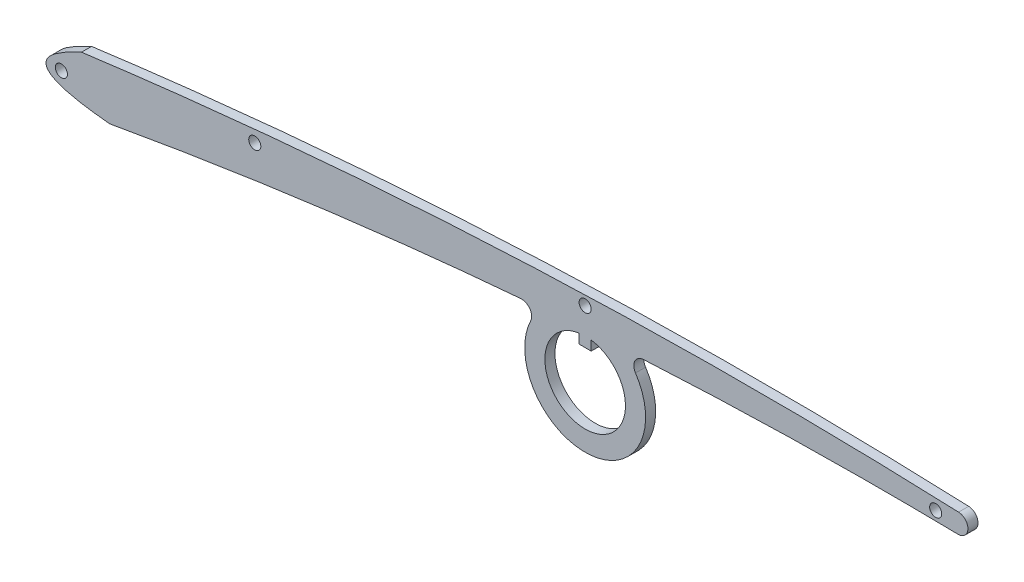
ISO-10303-21;
HEADER;
FILE_DESCRIPTION(('STEP AP214'),'2;1');
FILE_NAME('part.step','',(''),(''),'','','');
FILE_SCHEMA(('AUTOMOTIVE_DESIGN { 1 0 10303 214 1 1 1 1 }'));
ENDSEC;
DATA;
#1=APPLICATION_CONTEXT('core data for automotive mechanical design processes');
#2=APPLICATION_PROTOCOL_DEFINITION('international standard','automotive_design',2000,#1);
#3=PRODUCT_CONTEXT('',#1,'mechanical');
#4=PRODUCT('Part','Part','',(#3));
#5=PRODUCT_RELATED_PRODUCT_CATEGORY('part','',(#4));
#6=PRODUCT_DEFINITION_FORMATION('','',#4);
#7=PRODUCT_DEFINITION_CONTEXT('part definition',#1,'design');
#8=PRODUCT_DEFINITION('design','',#6,#7);
#9=PRODUCT_DEFINITION_SHAPE('','',#8);
#10=(LENGTH_UNIT() NAMED_UNIT(*) SI_UNIT(.MILLI.,.METRE.));
#11=(NAMED_UNIT(*) PLANE_ANGLE_UNIT() SI_UNIT($,.RADIAN.));
#12=(NAMED_UNIT(*) SI_UNIT($,.STERADIAN.) SOLID_ANGLE_UNIT());
#13=UNCERTAINTY_MEASURE_WITH_UNIT(LENGTH_MEASURE(1.E-05),#10,'distance_accuracy_value','');
#14=(GEOMETRIC_REPRESENTATION_CONTEXT(3) GLOBAL_UNCERTAINTY_ASSIGNED_CONTEXT((#13)) GLOBAL_UNIT_ASSIGNED_CONTEXT((#10,
#11,#12)) REPRESENTATION_CONTEXT('',''));
#15=CARTESIAN_POINT('',(0.,0.,0.));
#16=DIRECTION('',(0.,0.,1.));
#17=DIRECTION('',(1.,0.,0.));
#18=AXIS2_PLACEMENT_3D('',#15,#16,#17);
#19=CARTESIAN_POINT('',(43.5360182210527,1.99727418723005,0.3));
#20=CARTESIAN_POINT('',(43.5360182210527,1.99727418723005,0.283333333333333));
#21=CARTESIAN_POINT('',(43.5360182210524,1.99727418723005,0.266666666666667));
#22=CARTESIAN_POINT('',(43.5360182210524,1.99727418723005,0.0833333333333292));
#23=CARTESIAN_POINT('',(43.5360182210524,1.99727418723005,-0.0833333333333294));
#24=CARTESIAN_POINT('',(43.5360182210524,1.99727418723005,-0.266666666666667));
#25=CARTESIAN_POINT('',(43.5360182210527,1.99727418723005,-0.283333333333333));
#26=CARTESIAN_POINT('',(43.5360182210527,1.99727418723005,-0.3));
#27=CARTESIAN_POINT('',(44.4810390585838,1.95872875985098,0.3));
#28=CARTESIAN_POINT('',(44.4810390585838,1.95872875985098,0.283333333333333));
#29=CARTESIAN_POINT('',(44.4810390585842,1.95872875985125,0.266666666666667));
#30=CARTESIAN_POINT('',(44.4810390585842,1.95872875985125,0.0833333333333292));
#31=CARTESIAN_POINT('',(44.4810390585842,1.95872875985125,-0.0833333333333294));
#32=CARTESIAN_POINT('',(44.4810390585842,1.95872875985125,-0.266666666666667));
#33=CARTESIAN_POINT('',(44.4810390585838,1.95872875985098,-0.283333333333333));
#34=CARTESIAN_POINT('',(44.4810390585838,1.95872875985098,-0.3));
#35=CARTESIAN_POINT('',(44.4532468518573,1.01333057570577,0.3));
#36=CARTESIAN_POINT('',(44.4532468518573,1.01333057570577,0.283333333333333));
#37=CARTESIAN_POINT('',(44.4532468518577,1.01333057570546,0.266666666666667));
#38=CARTESIAN_POINT('',(44.4532468518577,1.01333057570546,0.0833333333333292));
#39=CARTESIAN_POINT('',(44.4532468518577,1.01333057570546,-0.0833333333333294));
#40=CARTESIAN_POINT('',(44.4532468518577,1.01333057570546,-0.266666666666667));
#41=CARTESIAN_POINT('',(44.4532468518573,1.01333057570577,-0.283333333333333));
#42=CARTESIAN_POINT('',(44.4532468518573,1.01333057570577,-0.3));
#43=CARTESIAN_POINT('',(43.5075936760809,1.03036596486664,0.3));
#44=CARTESIAN_POINT('',(43.5075936760809,1.03036596486664,0.283333333333333));
#45=CARTESIAN_POINT('',(43.5075936760807,1.03036596486664,0.266666666666667));
#46=CARTESIAN_POINT('',(43.5075936760807,1.03036596486664,0.0833333333333292));
#47=CARTESIAN_POINT('',(43.5075936760807,1.03036596486664,-0.0833333333333294));
#48=CARTESIAN_POINT('',(43.5075936760807,1.03036596486664,-0.266666666666667));
#49=CARTESIAN_POINT('',(43.5075936760809,1.03036596486664,-0.283333333333333));
#50=CARTESIAN_POINT('',(43.5075936760809,1.03036596486664,-0.3));
#51=(BOUNDED_SURFACE() B_SPLINE_SURFACE(3,3,((#19,#20,#21,#22,#23,#24,#25,#26),(#27,#28,#29,#30,
#31,#32,#33,#34),(#35,#36,#37,#38,#39,#40,#41,#42),(#43,#44,#45,#46,#47,#48,#49,#50)),
.UNSPECIFIED.,.F.,.F.,.F.) B_SPLINE_SURFACE_WITH_KNOTS((4,4),(4,2,2,4),(0.,1.),(-0.1,0.,1.,1.1),
.UNSPECIFIED.) GEOMETRIC_REPRESENTATION_ITEM() RATIONAL_B_SPLINE_SURFACE(((1.,1.,1.,1.,1.,1.,1.,
1.),(0.340917452765381,0.340917452765381,0.340917452765175,0.340917452765175,0.340917452765175,
0.340917452765175,0.340917452765381,0.340917452765381),(0.340917452765381,0.340917452765381,
0.340917452765175,0.340917452765175,0.340917452765175,0.340917452765175,0.340917452765381,
0.340917452765381),(1.,1.,1.,1.,1.,1.,1.,1.))) REPRESENTATION_ITEM('') SURFACE());
#52=CARTESIAN_POINT('',(43.5360182210524,1.99727418723005,0.250000000000008));
#53=DIRECTION('',(0.,0.,-1.));
#54=VECTOR('',#53,1.);
#55=LINE('',#52,#54);
#56=CARTESIAN_POINT('',(43.5360182210524,1.99727418723005,0.25));
#57=VERTEX_POINT('',#56);
#58=CARTESIAN_POINT('',(43.5360182210524,1.99727418723005,-0.25));
#59=VERTEX_POINT('',#58);
#60=EDGE_CURVE('E246',#57,#59,#55,.T.);
#61=CARTESIAN_POINT('',(43.5360182210524,1.99727418723005,0.25));
#62=CARTESIAN_POINT('',(44.4810390585842,1.95872875985125,0.25));
#63=CARTESIAN_POINT('',(44.4532468518577,1.01333057570546,0.25));
#64=CARTESIAN_POINT('',(43.5075936760807,1.03036596486664,0.25));
#65=(BOUNDED_CURVE() B_SPLINE_CURVE(3,(#61,#62,#63,#64),.UNSPECIFIED.,.F.,
.F.) B_SPLINE_CURVE_WITH_KNOTS((4,4),(0.,1.),
.UNSPECIFIED.) CURVE() GEOMETRIC_REPRESENTATION_ITEM() RATIONAL_B_SPLINE_CURVE((1.,
0.340917452765175,0.340917452765175,1.)) REPRESENTATION_ITEM(''));
#66=CARTESIAN_POINT('',(43.5075936760807,1.03036596486664,0.25));
#67=VERTEX_POINT('',#66);
#68=EDGE_CURVE('E49',#67,#57,#65,.F.);
#69=CARTESIAN_POINT('',(43.5075936760807,1.03036596486664,-0.250000000000009));
#70=DIRECTION('',(0.,0.,1.));
#71=VECTOR('',#70,1.);
#72=LINE('',#69,#71);
#73=CARTESIAN_POINT('',(43.5075936760807,1.03036596486664,-0.25));
#74=VERTEX_POINT('',#73);
#75=EDGE_CURVE('E251',#74,#67,#72,.T.);
#76=CARTESIAN_POINT('',(43.5075936760807,1.03036596486664,-0.25));
#77=CARTESIAN_POINT('',(44.4532468518577,1.01333057570546,-0.25));
#78=CARTESIAN_POINT('',(44.4810390585842,1.95872875985125,-0.25));
#79=CARTESIAN_POINT('',(43.5360182210524,1.99727418723005,-0.25));
#80=(BOUNDED_CURVE() B_SPLINE_CURVE(3,(#76,#77,#78,#79),.UNSPECIFIED.,.F.,
.F.) B_SPLINE_CURVE_WITH_KNOTS((4,4),(0.,1.),
.UNSPECIFIED.) CURVE() GEOMETRIC_REPRESENTATION_ITEM() RATIONAL_B_SPLINE_CURVE((1.,
0.340917452765175,0.340917452765175,1.)) REPRESENTATION_ITEM(''));
#81=EDGE_CURVE('E11',#59,#74,#80,.F.);
#82=ORIENTED_EDGE('',*,*,#60,.F.);
#83=ORIENTED_EDGE('',*,*,#68,.F.);
#84=ORIENTED_EDGE('',*,*,#75,.F.);
#85=ORIENTED_EDGE('',*,*,#81,.F.);
#86=EDGE_LOOP('',(#82,#83,#84,#85));
#87=FACE_BOUND('',#86,.T.);
#88=ADVANCED_FACE('F36',(#87),#51,.T.);
#89=CARTESIAN_POINT('',(1.4,-2.38,0.25));
#90=CARTESIAN_POINT('',(47.9545618267195,5.97686786365619,0.25));
#91=CARTESIAN_POINT('',(94.,-5.94,0.25));
#92=B_SPLINE_CURVE_WITH_KNOTS('',2,(#89,#90,#91),.UNSPECIFIED.,.F.,.F.,(3,3),(0.,1.),.UNSPECIFIED.);
#93=DIRECTION('',(0.,0.,-1.));
#94=VECTOR('',#93,1.);
#95=SURFACE_OF_LINEAR_EXTRUSION('',#92,#94);
#96=CARTESIAN_POINT('',(1.4,-2.38,-0.25));
#97=CARTESIAN_POINT('',(47.9545618267195,5.97686786365619,-0.25));
#98=CARTESIAN_POINT('',(94.,-5.94,-0.25));
#99=B_SPLINE_CURVE_WITH_KNOTS('',2,(#96,#97,#98),.UNSPECIFIED.,.F.,.F.,(3,3),(0.,1.),.UNSPECIFIED.);
#100=CARTESIAN_POINT('',(1.4,-2.38,-0.25));
#101=VERTEX_POINT('',#100);
#102=CARTESIAN_POINT('',(21.8018402597414,0.310938770262004,-0.25));
#103=VERTEX_POINT('',#102);
#104=EDGE_CURVE('E298',#101,#103,#99,.T.);
#105=ORIENTED_EDGE('',*,*,#104,.T.);
#106=DIRECTION('',(0.,0.,-1.));
#107=VECTOR('',#106,1.);
#108=CARTESIAN_POINT('',(21.8018402597414,0.310938770262003,-0.25));
#109=LINE('',#108,#107);
#110=CARTESIAN_POINT('',(21.8018402597414,0.310938770262004,0.25));
#111=VERTEX_POINT('',#110);
#112=EDGE_CURVE('E321',#103,#111,#109,.F.);
#113=ORIENTED_EDGE('',*,*,#112,.T.);
#114=CARTESIAN_POINT('',(1.4,-2.38,0.25));
#115=VERTEX_POINT('',#114);
#116=EDGE_CURVE('E211',#115,#111,#92,.T.);
#117=ORIENTED_EDGE('',*,*,#116,.F.);
#118=DIRECTION('',(0.,0.,-1.));
#119=VECTOR('',#118,1.);
#120=CARTESIAN_POINT('',(1.4,-2.38,0.25));
#121=LINE('',#120,#119);
#122=EDGE_CURVE('E262',#115,#101,#121,.T.);
#123=ORIENTED_EDGE('',*,*,#122,.T.);
#124=EDGE_LOOP('',(#105,#113,#117,#123));
#125=FACE_BOUND('',#124,.T.);
#126=ADVANCED_FACE('F227',(#125),#95,.F.);
#127=CARTESIAN_POINT('',(27.8873530453311,0.736269524725093,-0.25));
#128=VERTEX_POINT('',#127);
#129=EDGE_CURVE('E290',#128,#74,#99,.T.);
#130=ORIENTED_EDGE('',*,*,#129,.T.);
#131=ORIENTED_EDGE('',*,*,#75,.T.);
#132=CARTESIAN_POINT('',(27.8873530453311,0.736269524725093,0.25));
#133=VERTEX_POINT('',#132);
#134=EDGE_CURVE('E209',#133,#67,#92,.T.);
#135=ORIENTED_EDGE('',*,*,#134,.F.);
#136=DIRECTION('',(0.,0.,-1.));
#137=VECTOR('',#136,1.);
#138=CARTESIAN_POINT('',(27.8873530453311,0.736269524725093,0.25));
#139=LINE('',#138,#137);
#140=EDGE_CURVE('E323',#133,#128,#139,.T.);
#141=ORIENTED_EDGE('',*,*,#140,.T.);
#142=EDGE_LOOP('',(#130,#131,#135,#141));
#143=FACE_BOUND('',#142,.T.);
#144=ADVANCED_FACE('F225',(#143),#95,.F.);
#145=CARTESIAN_POINT('',(0.,0.,0.25));
#146=CARTESIAN_POINT('',(-4.123736473106,-1.85948761779572,0.25));
#147=CARTESIAN_POINT('',(1.4,-2.38,0.25));
#148=B_SPLINE_CURVE_WITH_KNOTS('',2,(#145,#146,#147),.UNSPECIFIED.,.F.,.F.,(3,3),(0.,1.),.UNSPECIFIED.);
#149=DIRECTION('',(0.,0.,-1.));
#150=VECTOR('',#149,1.);
#151=SURFACE_OF_LINEAR_EXTRUSION('',#148,#150);
#152=CARTESIAN_POINT('',(0.,0.,-0.25));
#153=CARTESIAN_POINT('',(-4.123736473106,-1.85948761779572,-0.25));
#154=CARTESIAN_POINT('',(1.4,-2.38,-0.25));
#155=B_SPLINE_CURVE_WITH_KNOTS('',2,(#152,#153,#154),.UNSPECIFIED.,.F.,.F.,(3,3),(0.,1.),.UNSPECIFIED.);
#156=CARTESIAN_POINT('',(0.,0.,-0.25));
#157=VERTEX_POINT('',#156);
#158=EDGE_CURVE('E182',#157,#101,#155,.T.);
#159=ORIENTED_EDGE('',*,*,#158,.T.);
#160=ORIENTED_EDGE('',*,*,#122,.F.);
#161=CARTESIAN_POINT('',(0.,0.,0.25));
#162=VERTEX_POINT('',#161);
#163=EDGE_CURVE('E203',#162,#115,#148,.T.);
#164=ORIENTED_EDGE('',*,*,#163,.F.);
#165=DIRECTION('',(0.,0.,-1.));
#166=VECTOR('',#165,1.);
#167=CARTESIAN_POINT('',(0.,0.,0.25));
#168=LINE('',#167,#166);
#169=EDGE_CURVE('E258',#162,#157,#168,.T.);
#170=ORIENTED_EDGE('',*,*,#169,.T.);
#171=EDGE_LOOP('',(#159,#160,#164,#170));
#172=FACE_BOUND('',#171,.T.);
#173=ADVANCED_FACE('F220',(#172),#151,.F.);
#174=CARTESIAN_POINT('',(94.3,-5.23,0.25));
#175=CARTESIAN_POINT('',(47.2732663174782,6.25577884848937,0.25));
#176=CARTESIAN_POINT('',(0.,0.,0.25));
#177=B_SPLINE_CURVE_WITH_KNOTS('',2,(#174,#175,#176),.UNSPECIFIED.,.F.,.F.,(3,3),(0.,1.),.UNSPECIFIED.);
#178=DIRECTION('',(0.,0.,-1.));
#179=VECTOR('',#178,1.);
#180=SURFACE_OF_LINEAR_EXTRUSION('',#177,#179);
#181=EDGE_CURVE('E256',#57,#162,#177,.T.);
#182=ORIENTED_EDGE('',*,*,#181,.F.);
#183=ORIENTED_EDGE('',*,*,#60,.T.);
#184=CARTESIAN_POINT('',(94.3,-5.23,-0.25));
#185=CARTESIAN_POINT('',(47.2732663174782,6.25577884848937,-0.25));
#186=CARTESIAN_POINT('',(0.,0.,-0.25));
#187=B_SPLINE_CURVE_WITH_KNOTS('',2,(#184,#185,#186),.UNSPECIFIED.,.F.,.F.,(3,3),(0.,1.),.UNSPECIFIED.);
#188=EDGE_CURVE('E210',#59,#157,#187,.T.);
#189=ORIENTED_EDGE('',*,*,#188,.T.);
#190=ORIENTED_EDGE('',*,*,#169,.F.);
#191=EDGE_LOOP('',(#182,#183,#189,#190));
#192=FACE_BOUND('',#191,.T.);
#193=ADVANCED_FACE('F224',(#192),#180,.F.);
#194=CARTESIAN_POINT('',(-1.711868236553,-1.52474380889786,0.25));
#195=DIRECTION('',(0.,0.,-1.));
#196=DIRECTION('',(-1.,0.,0.));
#197=AXIS2_PLACEMENT_3D('',#194,#195,#196);
#198=PLANE('',#197);
#199=CARTESIAN_POINT('',(-1.,-1.3,0.25));
#200=DIRECTION('',(0.,0.,1.));
#201=DIRECTION('',(1.,0.,0.));
#202=AXIS2_PLACEMENT_3D('',#199,#200,#201);
#203=CIRCLE('',#202,0.3);
#204=CARTESIAN_POINT('',(-0.7,-1.3,0.25));
#205=VERTEX_POINT('',#204);
#206=EDGE_CURVE('E183',#205,#205,#203,.T.);
#207=ORIENTED_EDGE('',*,*,#206,.F.);
#208=EDGE_LOOP('',(#207));
#209=FACE_BOUND('',#208,.T.);
#210=CARTESIAN_POINT('',(8.6,0.4,0.25));
#211=DIRECTION('',(0.,0.,1.));
#212=DIRECTION('',(1.,0.,0.));
#213=AXIS2_PLACEMENT_3D('',#210,#211,#212);
#214=CIRCLE('',#213,0.3);
#215=CARTESIAN_POINT('',(8.9,0.4,0.25));
#216=VERTEX_POINT('',#215);
#217=EDGE_CURVE('E189',#216,#216,#214,.T.);
#218=ORIENTED_EDGE('',*,*,#217,.F.);
#219=EDGE_LOOP('',(#218));
#220=FACE_BOUND('',#219,.T.);
#221=CARTESIAN_POINT('',(25.,1.6,0.25));
#222=DIRECTION('',(0.,0.,1.));
#223=DIRECTION('',(1.,0.,0.));
#224=AXIS2_PLACEMENT_3D('',#221,#222,#223);
#225=CIRCLE('',#224,0.300000000000004);
#226=CARTESIAN_POINT('',(25.3,1.6,0.25));
#227=VERTEX_POINT('',#226);
#228=EDGE_CURVE('E195',#227,#227,#225,.T.);
#229=ORIENTED_EDGE('',*,*,#228,.F.);
#230=EDGE_LOOP('',(#229));
#231=FACE_BOUND('',#230,.T.);
#232=CARTESIAN_POINT('',(42.4,1.5,0.25));
#233=DIRECTION('',(0.,0.,1.));
#234=DIRECTION('',(1.,0.,0.));
#235=AXIS2_PLACEMENT_3D('',#232,#233,#234);
#236=CIRCLE('',#235,0.300000000000004);
#237=CARTESIAN_POINT('',(42.7,1.5,0.25));
#238=VERTEX_POINT('',#237);
#239=EDGE_CURVE('E176',#238,#238,#236,.T.);
#240=ORIENTED_EDGE('',*,*,#239,.F.);
#241=EDGE_LOOP('',(#240));
#242=FACE_BOUND('',#241,.T.);
#243=ORIENTED_EDGE('',*,*,#134,.T.);
#244=ORIENTED_EDGE('',*,*,#68,.T.);
#245=ORIENTED_EDGE('',*,*,#181,.T.);
#246=ORIENTED_EDGE('',*,*,#163,.T.);
#247=ORIENTED_EDGE('',*,*,#116,.T.);
#248=CARTESIAN_POINT('',(21.8437780933207,-0.187299343609944,0.25));
#249=DIRECTION('',(0.,0.,-1.));
#250=DIRECTION('',(-1.,0.,0.));
#251=AXIS2_PLACEMENT_3D('',#248,#249,#250);
#252=CIRCLE('',#251,0.5);
#253=CARTESIAN_POINT('',(22.2946669371312,-0.40339943737956,0.25));
#254=VERTEX_POINT('',#253);
#255=EDGE_CURVE('E328',#111,#254,#252,.T.);
#256=ORIENTED_EDGE('',*,*,#255,.T.);
#257=CARTESIAN_POINT('',(25.,-1.7,0.25));
#258=DIRECTION('',(0.,0.,1.));
#259=DIRECTION('',(1.,0.,0.));
#260=AXIS2_PLACEMENT_3D('',#257,#258,#259);
#261=CIRCLE('',#260,3.00000000000644);
#262=CARTESIAN_POINT('',(27.498666781426,-0.0396794540099003,0.25));
#263=VERTEX_POINT('',#262);
#264=EDGE_CURVE('E173',#254,#263,#261,.T.);
#265=ORIENTED_EDGE('',*,*,#264,.T.);
#266=CARTESIAN_POINT('',(27.9151112449961,0.237040636987858,0.25));
#267=DIRECTION('',(0.,0.,-1.));
#268=DIRECTION('',(-1.,0.,0.));
#269=AXIS2_PLACEMENT_3D('',#266,#267,#268);
#270=CIRCLE('',#269,0.5);
#271=EDGE_CURVE('E252',#263,#133,#270,.T.);
#272=ORIENTED_EDGE('',*,*,#271,.T.);
#273=EDGE_LOOP('',(#243,#244,#245,#246,#247,#256,#265,#272));
#274=FACE_BOUND('',#273,.T.);
#275=DIRECTION('',(0.,-1.,0.));
#276=VECTOR('',#275,1.);
#277=CARTESIAN_POINT('',(25.3,0.277371993328519,0.25));
#278=LINE('',#277,#276);
#279=CARTESIAN_POINT('',(25.3,0.277371993328519,0.25));
#280=VERTEX_POINT('',#279);
#281=CARTESIAN_POINT('',(25.3,-0.2,0.25));
#282=VERTEX_POINT('',#281);
#283=EDGE_CURVE('E141',#280,#282,#278,.T.);
#284=ORIENTED_EDGE('',*,*,#283,.F.);
#285=CARTESIAN_POINT('',(25.,-1.7,0.25));
#286=DIRECTION('',(0.,0.,1.));
#287=DIRECTION('',(1.,0.,0.));
#288=AXIS2_PLACEMENT_3D('',#285,#286,#287);
#289=CIRCLE('',#288,2.);
#290=CARTESIAN_POINT('',(24.7,0.277371993328519,0.25));
#291=VERTEX_POINT('',#290);
#292=EDGE_CURVE('E131',#291,#280,#289,.T.);
#293=ORIENTED_EDGE('',*,*,#292,.F.);
#294=DIRECTION('',(0.,1.,0.));
#295=VECTOR('',#294,1.);
#296=CARTESIAN_POINT('',(24.7,0.277371993328519,0.25));
#297=LINE('',#296,#295);
#298=CARTESIAN_POINT('',(24.7,-0.2,0.25));
#299=VERTEX_POINT('',#298);
#300=EDGE_CURVE('E157',#299,#291,#297,.T.);
#301=ORIENTED_EDGE('',*,*,#300,.F.);
#302=DIRECTION('',(-1.,0.,0.));
#303=VECTOR('',#302,1.);
#304=CARTESIAN_POINT('',(24.7,-0.2,0.25));
#305=LINE('',#304,#303);
#306=EDGE_CURVE('E155',#282,#299,#305,.T.);
#307=ORIENTED_EDGE('',*,*,#306,.F.);
#308=EDGE_LOOP('',(#284,#293,#301,#307));
#309=FACE_BOUND('',#308,.T.);
#310=ADVANCED_FACE('F153',(#209,#220,#231,#242,#274,#309),#198,.F.);
#311=CARTESIAN_POINT('',(-1.711868236553,-1.52474380889786,-0.25));
#312=DIRECTION('',(0.,0.,-1.));
#313=DIRECTION('',(-1.,0.,0.));
#314=AXIS2_PLACEMENT_3D('',#311,#312,#313);
#315=PLANE('',#314);
#316=ORIENTED_EDGE('',*,*,#188,.F.);
#317=ORIENTED_EDGE('',*,*,#81,.T.);
#318=ORIENTED_EDGE('',*,*,#129,.F.);
#319=CARTESIAN_POINT('',(27.9151112449961,0.237040636987858,-0.25));
#320=DIRECTION('',(0.,0.,-1.));
#321=DIRECTION('',(-1.,0.,0.));
#322=AXIS2_PLACEMENT_3D('',#319,#320,#321);
#323=CIRCLE('',#322,0.5);
#324=CARTESIAN_POINT('',(27.498666781426,-0.0396794540099003,-0.25));
#325=VERTEX_POINT('',#324);
#326=EDGE_CURVE('E329',#128,#325,#323,.F.);
#327=ORIENTED_EDGE('',*,*,#326,.T.);
#328=CARTESIAN_POINT('',(25.,-1.7,-0.25));
#329=DIRECTION('',(0.,0.,1.));
#330=DIRECTION('',(1.,0.,0.));
#331=AXIS2_PLACEMENT_3D('',#328,#329,#330);
#332=CIRCLE('',#331,3.00000000000644);
#333=CARTESIAN_POINT('',(22.2946669371312,-0.40339943737956,-0.25));
#334=VERTEX_POINT('',#333);
#335=EDGE_CURVE('E149',#334,#325,#332,.T.);
#336=ORIENTED_EDGE('',*,*,#335,.F.);
#337=CARTESIAN_POINT('',(21.8437780933207,-0.187299343609944,-0.25));
#338=DIRECTION('',(0.,0.,-1.));
#339=DIRECTION('',(-1.,0.,0.));
#340=AXIS2_PLACEMENT_3D('',#337,#338,#339);
#341=CIRCLE('',#340,0.5);
#342=EDGE_CURVE('E326',#334,#103,#341,.F.);
#343=ORIENTED_EDGE('',*,*,#342,.T.);
#344=ORIENTED_EDGE('',*,*,#104,.F.);
#345=ORIENTED_EDGE('',*,*,#158,.F.);
#346=EDGE_LOOP('',(#316,#317,#318,#327,#336,#343,#344,#345));
#347=FACE_BOUND('',#346,.T.);
#348=CARTESIAN_POINT('',(-1.,-1.3,-0.25));
#349=DIRECTION('',(0.,0.,1.));
#350=DIRECTION('',(1.,0.,0.));
#351=AXIS2_PLACEMENT_3D('',#348,#349,#350);
#352=CIRCLE('',#351,0.3);
#353=CARTESIAN_POINT('',(-0.7,-1.3,-0.25));
#354=VERTEX_POINT('',#353);
#355=EDGE_CURVE('E179',#354,#354,#352,.T.);
#356=ORIENTED_EDGE('',*,*,#355,.T.);
#357=EDGE_LOOP('',(#356));
#358=FACE_BOUND('',#357,.T.);
#359=CARTESIAN_POINT('',(8.6,0.4,-0.25));
#360=DIRECTION('',(0.,0.,1.));
#361=DIRECTION('',(1.,0.,0.));
#362=AXIS2_PLACEMENT_3D('',#359,#360,#361);
#363=CIRCLE('',#362,0.3);
#364=CARTESIAN_POINT('',(8.9,0.4,-0.25));
#365=VERTEX_POINT('',#364);
#366=EDGE_CURVE('E186',#365,#365,#363,.T.);
#367=ORIENTED_EDGE('',*,*,#366,.T.);
#368=EDGE_LOOP('',(#367));
#369=FACE_BOUND('',#368,.T.);
#370=CARTESIAN_POINT('',(25.,1.6,-0.25));
#371=DIRECTION('',(0.,0.,1.));
#372=DIRECTION('',(1.,0.,0.));
#373=AXIS2_PLACEMENT_3D('',#370,#371,#372);
#374=CIRCLE('',#373,0.300000000000004);
#375=CARTESIAN_POINT('',(25.3,1.6,-0.25));
#376=VERTEX_POINT('',#375);
#377=EDGE_CURVE('E192',#376,#376,#374,.T.);
#378=ORIENTED_EDGE('',*,*,#377,.T.);
#379=EDGE_LOOP('',(#378));
#380=FACE_BOUND('',#379,.T.);
#381=CARTESIAN_POINT('',(42.4,1.5,-0.25));
#382=DIRECTION('',(0.,0.,1.));
#383=DIRECTION('',(1.,0.,0.));
#384=AXIS2_PLACEMENT_3D('',#381,#382,#383);
#385=CIRCLE('',#384,0.300000000000004);
#386=CARTESIAN_POINT('',(42.7,1.5,-0.25));
#387=VERTEX_POINT('',#386);
#388=EDGE_CURVE('E198',#387,#387,#385,.T.);
#389=ORIENTED_EDGE('',*,*,#388,.T.);
#390=EDGE_LOOP('',(#389));
#391=FACE_BOUND('',#390,.T.);
#392=CARTESIAN_POINT('',(25.,-1.7,-0.25));
#393=DIRECTION('',(0.,0.,1.));
#394=DIRECTION('',(1.,0.,0.));
#395=AXIS2_PLACEMENT_3D('',#392,#393,#394);
#396=CIRCLE('',#395,2.);
#397=CARTESIAN_POINT('',(24.7,0.277371993328519,-0.25));
#398=VERTEX_POINT('',#397);
#399=CARTESIAN_POINT('',(25.3,0.277371993328519,-0.25));
#400=VERTEX_POINT('',#399);
#401=EDGE_CURVE('E161',#398,#400,#396,.T.);
#402=ORIENTED_EDGE('',*,*,#401,.T.);
#403=DIRECTION('',(0.,-1.,0.));
#404=VECTOR('',#403,1.);
#405=CARTESIAN_POINT('',(25.3,0.277371993328519,-0.25));
#406=LINE('',#405,#404);
#407=CARTESIAN_POINT('',(25.3,-0.2,-0.25));
#408=VERTEX_POINT('',#407);
#409=EDGE_CURVE('E148',#400,#408,#406,.T.);
#410=ORIENTED_EDGE('',*,*,#409,.T.);
#411=DIRECTION('',(-1.,0.,0.));
#412=VECTOR('',#411,1.);
#413=CARTESIAN_POINT('',(24.7,-0.2,-0.25));
#414=LINE('',#413,#412);
#415=CARTESIAN_POINT('',(24.7,-0.2,-0.25));
#416=VERTEX_POINT('',#415);
#417=EDGE_CURVE('E164',#408,#416,#414,.T.);
#418=ORIENTED_EDGE('',*,*,#417,.T.);
#419=DIRECTION('',(0.,1.,0.));
#420=VECTOR('',#419,1.);
#421=CARTESIAN_POINT('',(24.7,0.277371993328519,-0.25));
#422=LINE('',#421,#420);
#423=EDGE_CURVE('E142',#416,#398,#422,.T.);
#424=ORIENTED_EDGE('',*,*,#423,.T.);
#425=EDGE_LOOP('',(#402,#410,#418,#424));
#426=FACE_BOUND('',#425,.T.);
#427=ADVANCED_FACE('F283',(#347,#358,#369,#380,#391,#426),#315,.T.);
#428=CARTESIAN_POINT('',(42.4,1.5,-0.25));
#429=DIRECTION('',(0.,0.,1.));
#430=DIRECTION('',(1.,0.,0.));
#431=AXIS2_PLACEMENT_3D('',#428,#429,#430);
#432=CYLINDRICAL_SURFACE('',#431,0.300000000000004);
#433=ORIENTED_EDGE('',*,*,#388,.F.);
#434=EDGE_LOOP('',(#433));
#435=FACE_BOUND('',#434,.T.);
#436=ORIENTED_EDGE('',*,*,#239,.T.);
#437=EDGE_LOOP('',(#436));
#438=FACE_BOUND('',#437,.T.);
#439=ADVANCED_FACE('F347',(#435,#438),#432,.F.);
#440=CARTESIAN_POINT('',(25.,1.6,-0.25));
#441=DIRECTION('',(0.,0.,1.));
#442=DIRECTION('',(1.,0.,0.));
#443=AXIS2_PLACEMENT_3D('',#440,#441,#442);
#444=CYLINDRICAL_SURFACE('',#443,0.300000000000004);
#445=ORIENTED_EDGE('',*,*,#377,.F.);
#446=EDGE_LOOP('',(#445));
#447=FACE_BOUND('',#446,.T.);
#448=ORIENTED_EDGE('',*,*,#228,.T.);
#449=EDGE_LOOP('',(#448));
#450=FACE_BOUND('',#449,.T.);
#451=ADVANCED_FACE('F381',(#447,#450),#444,.F.);
#452=CARTESIAN_POINT('',(8.6,0.4,-0.25));
#453=DIRECTION('',(0.,0.,1.));
#454=DIRECTION('',(1.,0.,0.));
#455=AXIS2_PLACEMENT_3D('',#452,#453,#454);
#456=CYLINDRICAL_SURFACE('',#455,0.3);
#457=ORIENTED_EDGE('',*,*,#366,.F.);
#458=EDGE_LOOP('',(#457));
#459=FACE_BOUND('',#458,.T.);
#460=ORIENTED_EDGE('',*,*,#217,.T.);
#461=EDGE_LOOP('',(#460));
#462=FACE_BOUND('',#461,.T.);
#463=ADVANCED_FACE('F377',(#459,#462),#456,.F.);
#464=CARTESIAN_POINT('',(-1.,-1.3,-0.25));
#465=DIRECTION('',(0.,0.,1.));
#466=DIRECTION('',(1.,0.,0.));
#467=AXIS2_PLACEMENT_3D('',#464,#465,#466);
#468=CYLINDRICAL_SURFACE('',#467,0.3);
#469=ORIENTED_EDGE('',*,*,#355,.F.);
#470=EDGE_LOOP('',(#469));
#471=FACE_BOUND('',#470,.T.);
#472=ORIENTED_EDGE('',*,*,#206,.T.);
#473=EDGE_LOOP('',(#472));
#474=FACE_BOUND('',#473,.T.);
#475=ADVANCED_FACE('F374',(#471,#474),#468,.F.);
#476=CARTESIAN_POINT('',(25.,-1.7,0.25));
#477=DIRECTION('',(0.,0.,-1.));
#478=DIRECTION('',(-1.,0.,0.));
#479=AXIS2_PLACEMENT_3D('',#476,#477,#478);
#480=CYLINDRICAL_SURFACE('',#479,3.00000000000644);
#481=ORIENTED_EDGE('',*,*,#264,.F.);
#482=DIRECTION('',(0.,0.,-1.));
#483=VECTOR('',#482,1.);
#484=CARTESIAN_POINT('',(22.2946669371312,-0.403399437379559,0.25));
#485=LINE('',#484,#483);
#486=EDGE_CURVE('E318',#254,#334,#485,.T.);
#487=ORIENTED_EDGE('',*,*,#486,.T.);
#488=ORIENTED_EDGE('',*,*,#335,.T.);
#489=DIRECTION('',(0.,0.,-1.));
#490=VECTOR('',#489,1.);
#491=CARTESIAN_POINT('',(27.498666781426,-0.0396794540099001,0.25));
#492=LINE('',#491,#490);
#493=EDGE_CURVE('E316',#325,#263,#492,.F.);
#494=ORIENTED_EDGE('',*,*,#493,.T.);
#495=EDGE_LOOP('',(#481,#487,#488,#494));
#496=FACE_BOUND('',#495,.T.);
#497=ADVANCED_FACE('F338',(#496),#480,.T.);
#498=CARTESIAN_POINT('',(25.,-1.7,0.25));
#499=DIRECTION('',(0.,0.,-1.));
#500=DIRECTION('',(-1.,0.,0.));
#501=AXIS2_PLACEMENT_3D('',#498,#499,#500);
#502=CYLINDRICAL_SURFACE('',#501,2.);
#503=ORIENTED_EDGE('',*,*,#401,.F.);
#504=DIRECTION('',(0.,0.,-1.));
#505=VECTOR('',#504,1.);
#506=CARTESIAN_POINT('',(24.7,0.277371993328519,0.25));
#507=LINE('',#506,#505);
#508=EDGE_CURVE('E137',#291,#398,#507,.T.);
#509=ORIENTED_EDGE('',*,*,#508,.F.);
#510=ORIENTED_EDGE('',*,*,#292,.T.);
#511=DIRECTION('',(0.,0.,-1.));
#512=VECTOR('',#511,1.);
#513=CARTESIAN_POINT('',(25.3,0.277371993328519,0.25));
#514=LINE('',#513,#512);
#515=EDGE_CURVE('E134',#280,#400,#514,.T.);
#516=ORIENTED_EDGE('',*,*,#515,.T.);
#517=EDGE_LOOP('',(#503,#509,#510,#516));
#518=FACE_BOUND('',#517,.T.);
#519=ADVANCED_FACE('F133',(#518),#502,.F.);
#520=CARTESIAN_POINT('',(25.3,0.277371993328519,0.25));
#521=DIRECTION('',(1.,0.,0.));
#522=DIRECTION('',(0.,0.,-1.));
#523=AXIS2_PLACEMENT_3D('',#520,#521,#522);
#524=PLANE('',#523);
#525=ORIENTED_EDGE('',*,*,#409,.F.);
#526=ORIENTED_EDGE('',*,*,#515,.F.);
#527=ORIENTED_EDGE('',*,*,#283,.T.);
#528=DIRECTION('',(0.,0.,-1.));
#529=VECTOR('',#528,1.);
#530=CARTESIAN_POINT('',(25.3,-0.2,0.25));
#531=LINE('',#530,#529);
#532=EDGE_CURVE('E150',#282,#408,#531,.T.);
#533=ORIENTED_EDGE('',*,*,#532,.T.);
#534=EDGE_LOOP('',(#525,#526,#527,#533));
#535=FACE_BOUND('',#534,.T.);
#536=ADVANCED_FACE('F145',(#535),#524,.T.);
#537=CARTESIAN_POINT('',(24.7,-0.2,0.25));
#538=DIRECTION('',(0.,-1.,0.));
#539=DIRECTION('',(0.,0.,-1.));
#540=AXIS2_PLACEMENT_3D('',#537,#538,#539);
#541=PLANE('',#540);
#542=ORIENTED_EDGE('',*,*,#417,.F.);
#543=ORIENTED_EDGE('',*,*,#532,.F.);
#544=ORIENTED_EDGE('',*,*,#306,.T.);
#545=DIRECTION('',(0.,0.,-1.));
#546=VECTOR('',#545,1.);
#547=CARTESIAN_POINT('',(24.7,-0.2,0.25));
#548=LINE('',#547,#546);
#549=EDGE_CURVE('E170',#299,#416,#548,.T.);
#550=ORIENTED_EDGE('',*,*,#549,.T.);
#551=EDGE_LOOP('',(#542,#543,#544,#550));
#552=FACE_BOUND('',#551,.T.);
#553=ADVANCED_FACE('F360',(#552),#541,.T.);
#554=CARTESIAN_POINT('',(24.7,0.277371993328519,0.25));
#555=DIRECTION('',(-1.,0.,0.));
#556=DIRECTION('',(0.,0.,1.));
#557=AXIS2_PLACEMENT_3D('',#554,#555,#556);
#558=PLANE('',#557);
#559=ORIENTED_EDGE('',*,*,#423,.F.);
#560=ORIENTED_EDGE('',*,*,#549,.F.);
#561=ORIENTED_EDGE('',*,*,#300,.T.);
#562=ORIENTED_EDGE('',*,*,#508,.T.);
#563=EDGE_LOOP('',(#559,#560,#561,#562));
#564=FACE_BOUND('',#563,.T.);
#565=ADVANCED_FACE('F233',(#564),#558,.T.);
#566=CARTESIAN_POINT('',(21.8437780933207,-0.187299343609944,0.));
#567=DIRECTION('',(0.,0.,-1.));
#568=DIRECTION('',(-1.,0.,0.));
#569=AXIS2_PLACEMENT_3D('',#566,#567,#568);
#570=CYLINDRICAL_SURFACE('',#569,0.5);
#571=ORIENTED_EDGE('',*,*,#255,.F.);
#572=ORIENTED_EDGE('',*,*,#112,.F.);
#573=ORIENTED_EDGE('',*,*,#342,.F.);
#574=ORIENTED_EDGE('',*,*,#486,.F.);
#575=EDGE_LOOP('',(#571,#572,#573,#574));
#576=FACE_BOUND('',#575,.T.);
#577=ADVANCED_FACE('F230',(#576),#570,.F.);
#578=CARTESIAN_POINT('',(27.9151112449961,0.237040636987858,0.));
#579=DIRECTION('',(0.,0.,-1.));
#580=DIRECTION('',(-1.,0.,0.));
#581=AXIS2_PLACEMENT_3D('',#578,#579,#580);
#582=CYLINDRICAL_SURFACE('',#581,0.5);
#583=ORIENTED_EDGE('',*,*,#271,.F.);
#584=ORIENTED_EDGE('',*,*,#493,.F.);
#585=ORIENTED_EDGE('',*,*,#326,.F.);
#586=ORIENTED_EDGE('',*,*,#140,.F.);
#587=EDGE_LOOP('',(#583,#584,#585,#586));
#588=FACE_BOUND('',#587,.T.);
#589=ADVANCED_FACE('F232',(#588),#582,.F.);
#590=CLOSED_SHELL('',(#88,#126,#144,#173,#193,#310,#427,#439,#451,#463,#475,#497,#519,#536,#553,
#565,#577,#589));
#591=MANIFOLD_SOLID_BREP('B2',#590);
#592=ADVANCED_BREP_SHAPE_REPRESENTATION('',(#18,#591),#14);
#593=SHAPE_DEFINITION_REPRESENTATION(#9,#592);
ENDSEC;
END-ISO-10303-21;
